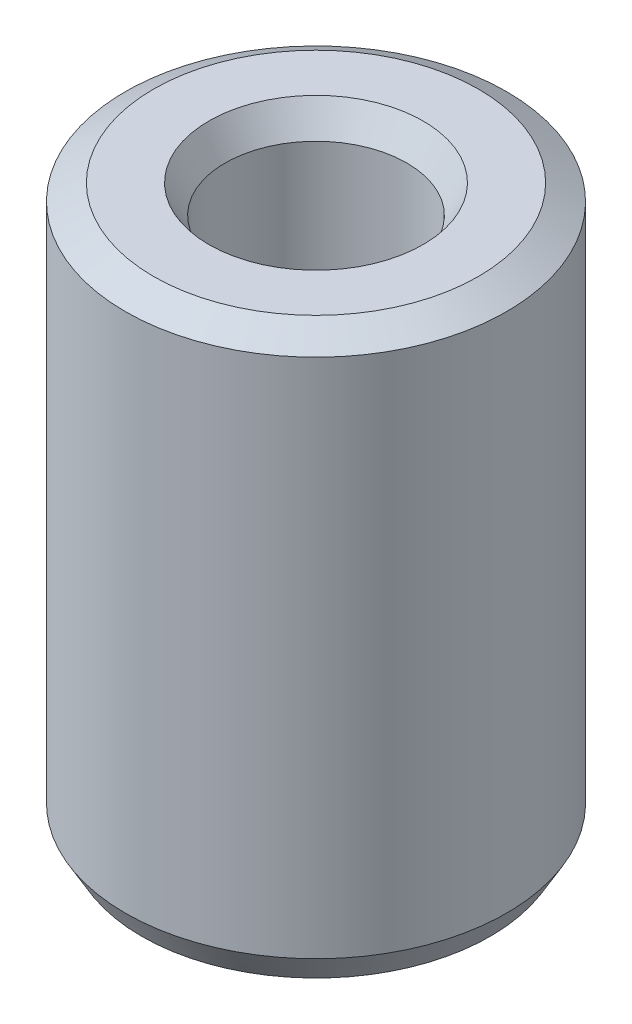
ISO-10303-21;
HEADER;
FILE_DESCRIPTION(('STEP AP214'),'2;1');
FILE_NAME('part.step','',(''),(''),'','','');
FILE_SCHEMA(('AUTOMOTIVE_DESIGN { 1 0 10303 214 1 1 1 1 }'));
ENDSEC;
DATA;
#1=APPLICATION_CONTEXT('core data for automotive mechanical design processes');
#2=APPLICATION_PROTOCOL_DEFINITION('international standard','automotive_design',2000,#1);
#3=PRODUCT_CONTEXT('',#1,'mechanical');
#4=PRODUCT('Part','Part','',(#3));
#5=PRODUCT_RELATED_PRODUCT_CATEGORY('part','',(#4));
#6=PRODUCT_DEFINITION_FORMATION('','',#4);
#7=PRODUCT_DEFINITION_CONTEXT('part definition',#1,'design');
#8=PRODUCT_DEFINITION('design','',#6,#7);
#9=PRODUCT_DEFINITION_SHAPE('','',#8);
#10=(LENGTH_UNIT() NAMED_UNIT(*) SI_UNIT(.MILLI.,.METRE.));
#11=(NAMED_UNIT(*) PLANE_ANGLE_UNIT() SI_UNIT($,.RADIAN.));
#12=(NAMED_UNIT(*) SI_UNIT($,.STERADIAN.) SOLID_ANGLE_UNIT());
#13=UNCERTAINTY_MEASURE_WITH_UNIT(LENGTH_MEASURE(1.E-05),#10,'distance_accuracy_value','');
#14=(GEOMETRIC_REPRESENTATION_CONTEXT(3) GLOBAL_UNCERTAINTY_ASSIGNED_CONTEXT((#13)) GLOBAL_UNIT_ASSIGNED_CONTEXT((#10,
#11,#12)) REPRESENTATION_CONTEXT('',''));
#15=CARTESIAN_POINT('',(0.,0.,0.));
#16=DIRECTION('',(0.,0.,1.));
#17=DIRECTION('',(1.,0.,0.));
#18=AXIS2_PLACEMENT_3D('',#15,#16,#17);
#19=CARTESIAN_POINT('',(0.,14.8336916023125,0.));
#20=DIRECTION('',(0.,-1.,0.));
#21=DIRECTION('',(0.,0.,-1.));
#22=AXIS2_PLACEMENT_3D('',#19,#20,#21);
#23=CYLINDRICAL_SURFACE('',#22,5.);
#24=CARTESIAN_POINT('',(0.,0.740411545935942,0.));
#25=DIRECTION('',(0.,1.,0.));
#26=DIRECTION('',(0.,0.,1.));
#27=AXIS2_PLACEMENT_3D('',#24,#25,#26);
#28=CIRCLE('',#27,5.);
#29=CARTESIAN_POINT('',(0.,0.740411545935942,5.));
#30=VERTEX_POINT('',#29);
#31=EDGE_CURVE('E10',#30,#30,#28,.T.);
#32=ORIENTED_EDGE('',*,*,#31,.T.);
#33=EDGE_LOOP('',(#32));
#34=FACE_BOUND('',#33,.T.);
#35=CARTESIAN_POINT('',(0.,14.4062147969553,0.));
#36=DIRECTION('',(0.,1.,0.));
#37=DIRECTION('',(0.,0.,1.));
#38=AXIS2_PLACEMENT_3D('',#35,#36,#37);
#39=CIRCLE('',#38,5.);
#40=CARTESIAN_POINT('',(0.,14.4062147969553,5.));
#41=VERTEX_POINT('',#40);
#42=EDGE_CURVE('E50',#41,#41,#39,.F.);
#43=ORIENTED_EDGE('',*,*,#42,.T.);
#44=EDGE_LOOP('',(#43));
#45=FACE_BOUND('',#44,.T.);
#46=ADVANCED_FACE('F39',(#34,#45),#23,.T.);
#47=CARTESIAN_POINT('',(0.,14.8336916023125,0.));
#48=DIRECTION('',(0.,1.,0.));
#49=DIRECTION('',(0.,0.,1.));
#50=AXIS2_PLACEMENT_3D('',#47,#48,#49);
#51=PLANE('',#50);
#52=CARTESIAN_POINT('',(0.,14.8336916023125,0.));
#53=DIRECTION('',(0.,1.,0.));
#54=DIRECTION('',(0.,0.,1.));
#55=AXIS2_PLACEMENT_3D('',#52,#53,#54);
#56=CIRCLE('',#55,2.80990145997035);
#57=CARTESIAN_POINT('',(0.,14.8336916023125,2.80990145997035));
#58=VERTEX_POINT('',#57);
#59=EDGE_CURVE('E58',#58,#58,#56,.F.);
#60=ORIENTED_EDGE('',*,*,#59,.T.);
#61=EDGE_LOOP('',(#60));
#62=FACE_BOUND('',#61,.T.);
#63=CARTESIAN_POINT('',(0.,14.8336916023125,0.));
#64=DIRECTION('',(0.,1.,0.));
#65=DIRECTION('',(0.,0.,1.));
#66=AXIS2_PLACEMENT_3D('',#63,#64,#65);
#67=CIRCLE('',#66,4.25958845406406);
#68=CARTESIAN_POINT('',(0.,14.8336916023125,4.25958845406406));
#69=VERTEX_POINT('',#68);
#70=EDGE_CURVE('E61',#69,#69,#67,.T.);
#71=ORIENTED_EDGE('',*,*,#70,.T.);
#72=EDGE_LOOP('',(#71));
#73=FACE_BOUND('',#72,.T.);
#74=ADVANCED_FACE('F88',(#62,#73),#51,.T.);
#75=CARTESIAN_POINT('',(0.,0.,0.));
#76=DIRECTION('',(0.,1.,0.));
#77=DIRECTION('',(0.,0.,1.));
#78=AXIS2_PLACEMENT_3D('',#75,#76,#77);
#79=PLANE('',#78);
#80=CARTESIAN_POINT('',(0.,0.,0.));
#81=DIRECTION('',(0.,1.,0.));
#82=DIRECTION('',(0.,0.,1.));
#83=AXIS2_PLACEMENT_3D('',#80,#81,#82);
#84=CIRCLE('',#83,3.12283620054907);
#85=CARTESIAN_POINT('',(0.,0.,3.12283620054907));
#86=VERTEX_POINT('',#85);
#87=EDGE_CURVE('E51',#86,#86,#84,.T.);
#88=ORIENTED_EDGE('',*,*,#87,.T.);
#89=EDGE_LOOP('',(#88));
#90=FACE_BOUND('',#89,.T.);
#91=CARTESIAN_POINT('',(0.,0.,0.));
#92=DIRECTION('',(0.,1.,0.));
#93=DIRECTION('',(0.,0.,1.));
#94=AXIS2_PLACEMENT_3D('',#91,#92,#93);
#95=CIRCLE('',#94,4.57252319464277);
#96=CARTESIAN_POINT('',(0.,0.,4.57252319464277));
#97=VERTEX_POINT('',#96);
#98=EDGE_CURVE('E54',#97,#97,#95,.F.);
#99=ORIENTED_EDGE('',*,*,#98,.T.);
#100=EDGE_LOOP('',(#99));
#101=FACE_BOUND('',#100,.T.);
#102=ADVANCED_FACE('F83',(#90,#101),#79,.F.);
#103=CARTESIAN_POINT('',(0.,14.8336916023125,0.));
#104=DIRECTION('',(0.,-1.,0.));
#105=DIRECTION('',(0.,0.,-1.));
#106=AXIS2_PLACEMENT_3D('',#103,#104,#105);
#107=CYLINDRICAL_SURFACE('',#106,2.38242465461312);
#108=CARTESIAN_POINT('',(0.,14.0932800563765,0.));
#109=DIRECTION('',(0.,1.,0.));
#110=DIRECTION('',(0.,0.,1.));
#111=AXIS2_PLACEMENT_3D('',#108,#109,#110);
#112=CIRCLE('',#111,2.38242465461312);
#113=CARTESIAN_POINT('',(0.,14.0932800563765,2.38242465461312));
#114=VERTEX_POINT('',#113);
#115=EDGE_CURVE('E67',#114,#114,#112,.T.);
#116=ORIENTED_EDGE('',*,*,#115,.T.);
#117=EDGE_LOOP('',(#116));
#118=FACE_BOUND('',#117,.T.);
#119=CARTESIAN_POINT('',(0.,0.427476805357228,0.));
#120=DIRECTION('',(0.,1.,0.));
#121=DIRECTION('',(0.,0.,1.));
#122=AXIS2_PLACEMENT_3D('',#119,#120,#121);
#123=CIRCLE('',#122,2.38242465461312);
#124=CARTESIAN_POINT('',(0.,0.427476805357228,2.38242465461312));
#125=VERTEX_POINT('',#124);
#126=EDGE_CURVE('E69',#125,#125,#123,.F.);
#127=ORIENTED_EDGE('',*,*,#126,.T.);
#128=EDGE_LOOP('',(#127));
#129=FACE_BOUND('',#128,.T.);
#130=ADVANCED_FACE('F71',(#118,#129),#107,.F.);
#131=CARTESIAN_POINT('',(0.,14.0932800563765,0.));
#132=DIRECTION('',(0.,1.,0.));
#133=DIRECTION('',(0.,0.,1.));
#134=AXIS2_PLACEMENT_3D('',#131,#132,#133);
#135=CONICAL_SURFACE('',#134,2.38242465461312,0.523598775598303);
#136=ORIENTED_EDGE('',*,*,#59,.F.);
#137=EDGE_LOOP('',(#136));
#138=FACE_BOUND('',#137,.T.);
#139=ORIENTED_EDGE('',*,*,#115,.F.);
#140=EDGE_LOOP('',(#139));
#141=FACE_BOUND('',#140,.T.);
#142=ADVANCED_FACE('F77',(#138,#141),#135,.F.);
#143=CARTESIAN_POINT('',(0.,0.,0.));
#144=DIRECTION('',(0.,-1.,0.));
#145=DIRECTION('',(0.,0.,-1.));
#146=AXIS2_PLACEMENT_3D('',#143,#144,#145);
#147=CONICAL_SURFACE('',#146,3.12283620054907,1.04719755119659);
#148=ORIENTED_EDGE('',*,*,#126,.F.);
#149=EDGE_LOOP('',(#148));
#150=FACE_BOUND('',#149,.T.);
#151=ORIENTED_EDGE('',*,*,#87,.F.);
#152=EDGE_LOOP('',(#151));
#153=FACE_BOUND('',#152,.T.);
#154=ADVANCED_FACE('F73',(#150,#153),#147,.F.);
#155=CARTESIAN_POINT('',(0.,0.740411545935942,0.));
#156=DIRECTION('',(0.,1.,0.));
#157=DIRECTION('',(0.,0.,1.));
#158=AXIS2_PLACEMENT_3D('',#155,#156,#157);
#159=CONICAL_SURFACE('',#158,5.,0.523598775598303);
#160=ORIENTED_EDGE('',*,*,#98,.F.);
#161=EDGE_LOOP('',(#160));
#162=FACE_BOUND('',#161,.T.);
#163=ORIENTED_EDGE('',*,*,#31,.F.);
#164=EDGE_LOOP('',(#163));
#165=FACE_BOUND('',#164,.T.);
#166=ADVANCED_FACE('F76',(#162,#165),#159,.T.);
#167=CARTESIAN_POINT('',(0.,14.8336916023125,0.));
#168=DIRECTION('',(0.,-1.,0.));
#169=DIRECTION('',(0.,0.,-1.));
#170=AXIS2_PLACEMENT_3D('',#167,#168,#169);
#171=CONICAL_SURFACE('',#170,4.25958845406406,1.04719755119659);
#172=ORIENTED_EDGE('',*,*,#42,.F.);
#173=EDGE_LOOP('',(#172));
#174=FACE_BOUND('',#173,.T.);
#175=ORIENTED_EDGE('',*,*,#70,.F.);
#176=EDGE_LOOP('',(#175));
#177=FACE_BOUND('',#176,.T.);
#178=ADVANCED_FACE('F45',(#174,#177),#171,.T.);
#179=CLOSED_SHELL('',(#46,#74,#102,#130,#142,#154,#166,#178));
#180=MANIFOLD_SOLID_BREP('B2',#179);
#181=ADVANCED_BREP_SHAPE_REPRESENTATION('',(#18,#180),#14);
#182=SHAPE_DEFINITION_REPRESENTATION(#9,#181);
ENDSEC;
END-ISO-10303-21;
